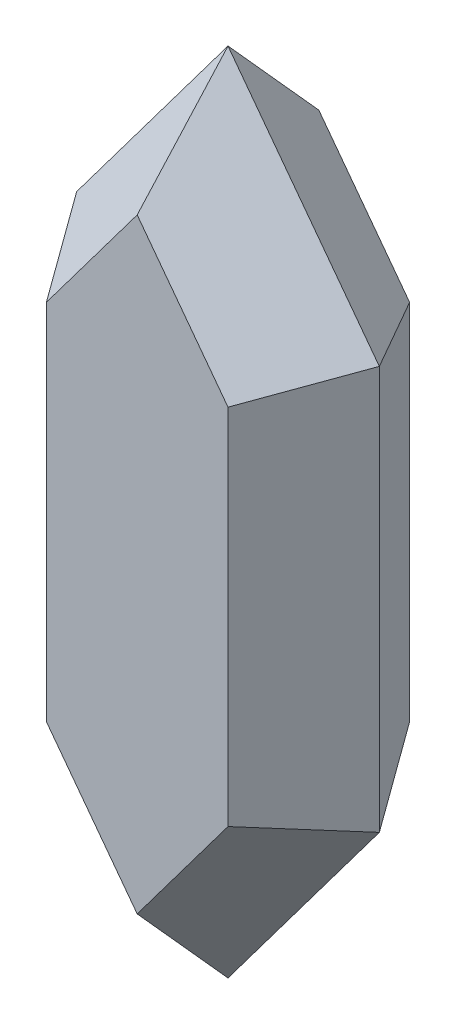
ISO-10303-21;
HEADER;
FILE_DESCRIPTION(('STEP AP214'),'2;1');
FILE_NAME('part.step','',(''),(''),'','','');
FILE_SCHEMA(('AUTOMOTIVE_DESIGN { 1 0 10303 214 1 1 1 1 }'));
ENDSEC;
DATA;
#1=APPLICATION_CONTEXT('core data for automotive mechanical design processes');
#2=APPLICATION_PROTOCOL_DEFINITION('international standard','automotive_design',2000,#1);
#3=PRODUCT_CONTEXT('',#1,'mechanical');
#4=PRODUCT('Part','Part','',(#3));
#5=PRODUCT_RELATED_PRODUCT_CATEGORY('part','',(#4));
#6=PRODUCT_DEFINITION_FORMATION('','',#4);
#7=PRODUCT_DEFINITION_CONTEXT('part definition',#1,'design');
#8=PRODUCT_DEFINITION('design','',#6,#7);
#9=PRODUCT_DEFINITION_SHAPE('','',#8);
#10=(LENGTH_UNIT() NAMED_UNIT(*) SI_UNIT(.MILLI.,.METRE.));
#11=(NAMED_UNIT(*) PLANE_ANGLE_UNIT() SI_UNIT($,.RADIAN.));
#12=(NAMED_UNIT(*) SI_UNIT($,.STERADIAN.) SOLID_ANGLE_UNIT());
#13=UNCERTAINTY_MEASURE_WITH_UNIT(LENGTH_MEASURE(1.E-05),#10,'distance_accuracy_value','');
#14=(GEOMETRIC_REPRESENTATION_CONTEXT(3) GLOBAL_UNCERTAINTY_ASSIGNED_CONTEXT((#13)) GLOBAL_UNIT_ASSIGNED_CONTEXT((#10,
#11,#12)) REPRESENTATION_CONTEXT('',''));
#15=CARTESIAN_POINT('',(0.,0.,0.));
#16=DIRECTION('',(0.,0.,1.));
#17=DIRECTION('',(1.,0.,0.));
#18=AXIS2_PLACEMENT_3D('',#15,#16,#17);
#19=CARTESIAN_POINT('',(0.,0.,9.));
#20=DIRECTION('',(0.,0.,1.));
#21=DIRECTION('',(1.,0.,0.));
#22=AXIS2_PLACEMENT_3D('',#19,#20,#21);
#23=PLANE('',#22);
#24=DIRECTION('',(-0.6,-0.8,0.));
#25=VECTOR('',#24,1.);
#26=CARTESIAN_POINT('',(12.5,50.,9.));
#27=LINE('',#26,#25);
#28=CARTESIAN_POINT('',(12.5,50.,9.));
#29=VERTEX_POINT('',#28);
#30=CARTESIAN_POINT('',(3.5,38.,9.));
#31=VERTEX_POINT('',#30);
#32=EDGE_CURVE('E315',#29,#31,#27,.T.);
#33=ORIENTED_EDGE('',*,*,#32,.T.);
#34=DIRECTION('',(0.,-1.,0.));
#35=VECTOR('',#34,1.);
#36=CARTESIAN_POINT('',(3.5,38.,9.));
#37=LINE('',#36,#35);
#38=CARTESIAN_POINT('',(3.5,2.00000000000001,9.));
#39=VERTEX_POINT('',#38);
#40=EDGE_CURVE('E299',#31,#39,#37,.T.);
#41=ORIENTED_EDGE('',*,*,#40,.T.);
#42=DIRECTION('',(0.6,-0.8,0.));
#43=VECTOR('',#42,1.);
#44=CARTESIAN_POINT('',(3.5,2.00000000000001,9.));
#45=LINE('',#44,#43);
#46=CARTESIAN_POINT('',(12.5,-10.,9.));
#47=VERTEX_POINT('',#46);
#48=EDGE_CURVE('E178',#39,#47,#45,.T.);
#49=ORIENTED_EDGE('',*,*,#48,.T.);
#50=DIRECTION('',(0.6,0.8,0.));
#51=VECTOR('',#50,1.);
#52=CARTESIAN_POINT('',(12.5,-10.,9.));
#53=LINE('',#52,#51);
#54=CARTESIAN_POINT('',(21.5,2.,9.));
#55=VERTEX_POINT('',#54);
#56=EDGE_CURVE('E317',#47,#55,#53,.T.);
#57=ORIENTED_EDGE('',*,*,#56,.T.);
#58=DIRECTION('',(0.,1.,0.));
#59=VECTOR('',#58,1.);
#60=CARTESIAN_POINT('',(21.5,2.,9.));
#61=LINE('',#60,#59);
#62=CARTESIAN_POINT('',(21.5,38.,9.));
#63=VERTEX_POINT('',#62);
#64=EDGE_CURVE('E70',#55,#63,#61,.T.);
#65=ORIENTED_EDGE('',*,*,#64,.T.);
#66=DIRECTION('',(-0.6,0.8,0.));
#67=VECTOR('',#66,1.);
#68=CARTESIAN_POINT('',(21.5,38.,9.));
#69=LINE('',#68,#67);
#70=EDGE_CURVE('E12',#63,#29,#69,.T.);
#71=ORIENTED_EDGE('',*,*,#70,.T.);
#72=EDGE_LOOP('',(#33,#41,#49,#57,#65,#71));
#73=FACE_BOUND('',#72,.T.);
#74=ADVANCED_FACE('F60',(#73),#23,.T.);
#75=CARTESIAN_POINT('',(-1.73076923076923,0.,1.15384615384615));
#76=DIRECTION('',(0.832050294337844,0.,-0.554700196225229));
#77=DIRECTION('',(-0.554700196225229,0.,-0.832050294337844));
#78=AXIS2_PLACEMENT_3D('',#75,#76,#77);
#79=PLANE('',#78);
#80=DIRECTION('',(0.545454545454545,0.181818181818182,0.818181818181818));
#81=VECTOR('',#80,1.);
#82=CARTESIAN_POINT('',(-2.49999999999999,0.,0.));
#83=LINE('',#82,#81);
#84=CARTESIAN_POINT('',(-2.49999999999999,0.,0.));
#85=VERTEX_POINT('',#84);
#86=EDGE_CURVE('E160',#85,#39,#83,.T.);
#87=ORIENTED_EDGE('',*,*,#86,.T.);
#88=ORIENTED_EDGE('',*,*,#40,.F.);
#89=DIRECTION('',(0.545454545454546,-0.181818181818181,0.818181818181818));
#90=VECTOR('',#89,1.);
#91=CARTESIAN_POINT('',(-2.5,40.,0.));
#92=LINE('',#91,#90);
#93=CARTESIAN_POINT('',(-2.5,40.,0.));
#94=VERTEX_POINT('',#93);
#95=EDGE_CURVE('E170',#94,#31,#92,.T.);
#96=ORIENTED_EDGE('',*,*,#95,.F.);
#97=DIRECTION('',(0.,-1.,0.));
#98=VECTOR('',#97,1.);
#99=CARTESIAN_POINT('',(-2.49999999999999,0.,0.));
#100=LINE('',#99,#98);
#101=EDGE_CURVE('E140',#94,#85,#100,.T.);
#102=ORIENTED_EDGE('',*,*,#101,.T.);
#103=EDGE_LOOP('',(#87,#88,#96,#102));
#104=FACE_BOUND('',#103,.T.);
#105=ADVANCED_FACE('F167',(#104),#79,.F.);
#106=CARTESIAN_POINT('',(-14.4,10.8,12.));
#107=DIRECTION('',(0.665640235470275,-0.499230176602706,-0.554700196225229));
#108=DIRECTION('',(-0.64018439966448,0.,-0.768221279597376));
#109=AXIS2_PLACEMENT_3D('',#106,#107,#108);
#110=PLANE('',#109);
#111=ORIENTED_EDGE('',*,*,#95,.T.);
#112=ORIENTED_EDGE('',*,*,#32,.F.);
#113=DIRECTION('',(0.,-0.743294146247166,0.66896473162245));
#114=VECTOR('',#113,1.);
#115=CARTESIAN_POINT('',(12.5,60.,0.));
#116=LINE('',#115,#114);
#117=CARTESIAN_POINT('',(12.5,60.,0.));
#118=VERTEX_POINT('',#117);
#119=EDGE_CURVE('E265',#118,#29,#116,.T.);
#120=ORIENTED_EDGE('',*,*,#119,.F.);
#121=DIRECTION('',(-0.6,-0.8,0.));
#122=VECTOR('',#121,1.);
#123=CARTESIAN_POINT('',(12.5,60.,0.));
#124=LINE('',#123,#122);
#125=EDGE_CURVE('E171',#118,#94,#124,.T.);
#126=ORIENTED_EDGE('',*,*,#125,.T.);
#127=EDGE_LOOP('',(#111,#112,#120,#126));
#128=FACE_BOUND('',#127,.T.);
#129=ADVANCED_FACE('F264',(#128),#110,.F.);
#130=CARTESIAN_POINT('',(-1.1076923076923,-0.830769230769227,0.923076923076919));
#131=DIRECTION('',(0.665640235470275,0.499230176602706,-0.554700196225229));
#132=DIRECTION('',(-0.64018439966448,0.,-0.768221279597376));
#133=AXIS2_PLACEMENT_3D('',#130,#131,#132);
#134=PLANE('',#133);
#135=DIRECTION('',(0.,0.743294146247166,0.66896473162245));
#136=VECTOR('',#135,1.);
#137=CARTESIAN_POINT('',(12.5,-20.,0.));
#138=LINE('',#137,#136);
#139=CARTESIAN_POINT('',(12.5,-20.,0.));
#140=VERTEX_POINT('',#139);
#141=EDGE_CURVE('E181',#140,#47,#138,.T.);
#142=ORIENTED_EDGE('',*,*,#141,.T.);
#143=ORIENTED_EDGE('',*,*,#48,.F.);
#144=ORIENTED_EDGE('',*,*,#86,.F.);
#145=DIRECTION('',(0.6,-0.8,0.));
#146=VECTOR('',#145,1.);
#147=CARTESIAN_POINT('',(12.5,-20.,0.));
#148=LINE('',#147,#146);
#149=EDGE_CURVE('E151',#85,#140,#148,.T.);
#150=ORIENTED_EDGE('',*,*,#149,.T.);
#151=EDGE_LOOP('',(#142,#143,#144,#150));
#152=FACE_BOUND('',#151,.T.);
#153=ADVANCED_FACE('F176',(#152),#134,.F.);
#154=CARTESIAN_POINT('',(12.1846153846154,-9.13846153846154,10.1538461538461));
#155=DIRECTION('',(-0.665640235470275,0.499230176602706,-0.554700196225229));
#156=DIRECTION('',(-0.64018439966448,0.,0.768221279597376));
#157=AXIS2_PLACEMENT_3D('',#154,#155,#156);
#158=PLANE('',#157);
#159=DIRECTION('',(-0.545454545454545,0.181818181818181,0.818181818181818));
#160=VECTOR('',#159,1.);
#161=CARTESIAN_POINT('',(27.5,0.,0.));
#162=LINE('',#161,#160);
#163=CARTESIAN_POINT('',(27.5,0.,0.));
#164=VERTEX_POINT('',#163);
#165=EDGE_CURVE('E191',#164,#55,#162,.T.);
#166=ORIENTED_EDGE('',*,*,#165,.T.);
#167=ORIENTED_EDGE('',*,*,#56,.F.);
#168=ORIENTED_EDGE('',*,*,#141,.F.);
#169=DIRECTION('',(0.6,0.8,0.));
#170=VECTOR('',#169,1.);
#171=CARTESIAN_POINT('',(12.5,-20.,0.));
#172=LINE('',#171,#170);
#173=EDGE_CURVE('E64',#140,#164,#172,.T.);
#174=ORIENTED_EDGE('',*,*,#173,.T.);
#175=EDGE_LOOP('',(#166,#167,#168,#174));
#176=FACE_BOUND('',#175,.T.);
#177=ADVANCED_FACE('F205',(#176),#158,.F.);
#178=CARTESIAN_POINT('',(19.0384615384616,0.,12.6923076923077));
#179=DIRECTION('',(-0.832050294337844,0.,-0.554700196225229));
#180=DIRECTION('',(-0.554700196225229,0.,0.832050294337844));
#181=AXIS2_PLACEMENT_3D('',#178,#179,#180);
#182=PLANE('',#181);
#183=DIRECTION('',(-0.545454545454545,-0.181818181818182,0.818181818181818));
#184=VECTOR('',#183,1.);
#185=CARTESIAN_POINT('',(27.5,40.,0.));
#186=LINE('',#185,#184);
#187=CARTESIAN_POINT('',(27.5,40.,0.));
#188=VERTEX_POINT('',#187);
#189=EDGE_CURVE('E85',#188,#63,#186,.T.);
#190=ORIENTED_EDGE('',*,*,#189,.T.);
#191=ORIENTED_EDGE('',*,*,#64,.F.);
#192=ORIENTED_EDGE('',*,*,#165,.F.);
#193=DIRECTION('',(0.,1.,0.));
#194=VECTOR('',#193,1.);
#195=CARTESIAN_POINT('',(27.5,0.,0.));
#196=LINE('',#195,#194);
#197=EDGE_CURVE('E254',#164,#188,#196,.T.);
#198=ORIENTED_EDGE('',*,*,#197,.T.);
#199=EDGE_LOOP('',(#190,#191,#192,#198));
#200=FACE_BOUND('',#199,.T.);
#201=ADVANCED_FACE('F214',(#200),#182,.F.);
#202=CARTESIAN_POINT('',(25.4769230769231,19.1076923076923,21.2307692307692));
#203=DIRECTION('',(-0.665640235470275,-0.499230176602706,-0.554700196225228));
#204=DIRECTION('',(-0.640184399664479,0.,0.768221279597376));
#205=AXIS2_PLACEMENT_3D('',#202,#203,#204);
#206=PLANE('',#205);
#207=ORIENTED_EDGE('',*,*,#119,.T.);
#208=ORIENTED_EDGE('',*,*,#70,.F.);
#209=ORIENTED_EDGE('',*,*,#189,.F.);
#210=DIRECTION('',(-0.6,0.8,0.));
#211=VECTOR('',#210,1.);
#212=CARTESIAN_POINT('',(12.5,60.,0.));
#213=LINE('',#212,#211);
#214=EDGE_CURVE('E255',#188,#118,#213,.T.);
#215=ORIENTED_EDGE('',*,*,#214,.T.);
#216=EDGE_LOOP('',(#207,#208,#209,#215));
#217=FACE_BOUND('',#216,.T.);
#218=ADVANCED_FACE('F379',(#217),#206,.F.);
#219=CARTESIAN_POINT('',(0.,0.,-9.));
#220=DIRECTION('',(0.,0.,1.));
#221=DIRECTION('',(1.,0.,0.));
#222=AXIS2_PLACEMENT_3D('',#219,#220,#221);
#223=PLANE('',#222);
#224=DIRECTION('',(0.,-1.,0.));
#225=VECTOR('',#224,1.);
#226=CARTESIAN_POINT('',(21.4999999999999,2.,-9.00000000000015));
#227=LINE('',#226,#225);
#228=CARTESIAN_POINT('',(21.4999999999999,38.,-9.00000000000015));
#229=VERTEX_POINT('',#228);
#230=CARTESIAN_POINT('',(21.4999999999999,2.,-9.00000000000015));
#231=VERTEX_POINT('',#230);
#232=EDGE_CURVE('E624',#229,#231,#227,.T.);
#233=ORIENTED_EDGE('',*,*,#232,.T.);
#234=DIRECTION('',(-0.6,-0.8,0.));
#235=VECTOR('',#234,1.);
#236=CARTESIAN_POINT('',(12.4999999999999,-10.,-9.00000000000009));
#237=LINE('',#236,#235);
#238=CARTESIAN_POINT('',(12.4999999999999,-10.,-9.00000000000009));
#239=VERTEX_POINT('',#238);
#240=EDGE_CURVE('E172',#231,#239,#237,.T.);
#241=ORIENTED_EDGE('',*,*,#240,.T.);
#242=DIRECTION('',(-0.6,0.8,0.));
#243=VECTOR('',#242,1.);
#244=CARTESIAN_POINT('',(3.49999999999994,2.00000000000001,-9.00000000000002));
#245=LINE('',#244,#243);
#246=CARTESIAN_POINT('',(3.49999999999994,2.00000000000001,-9.00000000000002));
#247=VERTEX_POINT('',#246);
#248=EDGE_CURVE('E590',#239,#247,#245,.T.);
#249=ORIENTED_EDGE('',*,*,#248,.T.);
#250=DIRECTION('',(0.,1.,0.));
#251=VECTOR('',#250,1.);
#252=CARTESIAN_POINT('',(3.49999999999994,38.,-9.00000000000002));
#253=LINE('',#252,#251);
#254=CARTESIAN_POINT('',(3.49999999999994,38.,-9.00000000000002));
#255=VERTEX_POINT('',#254);
#256=EDGE_CURVE('E143',#247,#255,#253,.T.);
#257=ORIENTED_EDGE('',*,*,#256,.T.);
#258=DIRECTION('',(0.6,0.8,0.));
#259=VECTOR('',#258,1.);
#260=CARTESIAN_POINT('',(12.4999999999999,50.,-9.00000000000009));
#261=LINE('',#260,#259);
#262=CARTESIAN_POINT('',(12.4999999999999,50.,-9.00000000000009));
#263=VERTEX_POINT('',#262);
#264=EDGE_CURVE('E628',#255,#263,#261,.T.);
#265=ORIENTED_EDGE('',*,*,#264,.T.);
#266=DIRECTION('',(0.6,-0.8,0.));
#267=VECTOR('',#266,1.);
#268=CARTESIAN_POINT('',(21.4999999999999,38.,-9.00000000000015));
#269=LINE('',#268,#267);
#270=EDGE_CURVE('E524',#263,#229,#269,.T.);
#271=ORIENTED_EDGE('',*,*,#270,.T.);
#272=EDGE_LOOP('',(#233,#241,#249,#257,#265,#271));
#273=FACE_BOUND('',#272,.T.);
#274=ADVANCED_FACE('F387',(#273),#223,.F.);
#275=CARTESIAN_POINT('',(19.0384615384616,0.,-12.6923076923077));
#276=DIRECTION('',(-0.832050294337845,0.,0.554700196225227));
#277=DIRECTION('',(0.554700196225227,0.,0.832050294337845));
#278=AXIS2_PLACEMENT_3D('',#275,#276,#277);
#279=PLANE('',#278);
#280=DIRECTION('',(-0.545454545454543,0.181818181818179,-0.81818181818182));
#281=VECTOR('',#280,1.);
#282=CARTESIAN_POINT('',(27.5,0.,0.));
#283=LINE('',#282,#281);
#284=EDGE_CURVE('E552',#164,#231,#283,.T.);
#285=ORIENTED_EDGE('',*,*,#284,.T.);
#286=ORIENTED_EDGE('',*,*,#232,.F.);
#287=DIRECTION('',(-0.545454545454543,-0.181818181818179,-0.81818181818182));
#288=VECTOR('',#287,1.);
#289=CARTESIAN_POINT('',(27.5,40.,0.));
#290=LINE('',#289,#288);
#291=EDGE_CURVE('E545',#188,#229,#290,.T.);
#292=ORIENTED_EDGE('',*,*,#291,.F.);
#293=ORIENTED_EDGE('',*,*,#197,.F.);
#294=EDGE_LOOP('',(#285,#286,#292,#293));
#295=FACE_BOUND('',#294,.T.);
#296=ADVANCED_FACE('F408',(#295),#279,.F.);
#297=CARTESIAN_POINT('',(25.4769230769232,19.1076923076925,-21.2307692307692));
#298=DIRECTION('',(-0.665640235470275,-0.49923017660271,0.554700196225225));
#299=DIRECTION('',(0.640184399664477,0.,0.768221279597378));
#300=AXIS2_PLACEMENT_3D('',#297,#298,#299);
#301=PLANE('',#300);
#302=ORIENTED_EDGE('',*,*,#291,.T.);
#303=ORIENTED_EDGE('',*,*,#270,.F.);
#304=DIRECTION('',(0.,-0.743294146247163,-0.668964731622453));
#305=VECTOR('',#304,1.);
#306=CARTESIAN_POINT('',(12.5,60.,0.));
#307=LINE('',#306,#305);
#308=EDGE_CURVE('E622',#118,#263,#307,.T.);
#309=ORIENTED_EDGE('',*,*,#308,.F.);
#310=ORIENTED_EDGE('',*,*,#214,.F.);
#311=EDGE_LOOP('',(#302,#303,#309,#310));
#312=FACE_BOUND('',#311,.T.);
#313=ADVANCED_FACE('F452',(#312),#301,.F.);
#314=CARTESIAN_POINT('',(12.1846153846154,-9.13846153846157,-10.1538461538462));
#315=DIRECTION('',(-0.665640235470273,0.499230176602708,0.55470019622523));
#316=DIRECTION('',(0.640184399664481,0.,0.768221279597374));
#317=AXIS2_PLACEMENT_3D('',#314,#315,#316);
#318=PLANE('',#317);
#319=DIRECTION('',(0.,0.743294146247163,-0.668964731622453));
#320=VECTOR('',#319,1.);
#321=CARTESIAN_POINT('',(12.5,-20.,0.));
#322=LINE('',#321,#320);
#323=EDGE_CURVE('E148',#140,#239,#322,.T.);
#324=ORIENTED_EDGE('',*,*,#323,.T.);
#325=ORIENTED_EDGE('',*,*,#240,.F.);
#326=ORIENTED_EDGE('',*,*,#284,.F.);
#327=ORIENTED_EDGE('',*,*,#173,.F.);
#328=EDGE_LOOP('',(#324,#325,#326,#327));
#329=FACE_BOUND('',#328,.T.);
#330=ADVANCED_FACE('F462',(#329),#318,.F.);
#331=CARTESIAN_POINT('',(-1.10769230769232,-0.830769230769232,-0.923076923076918));
#332=DIRECTION('',(0.665640235470278,0.499230176602706,0.554700196225225));
#333=DIRECTION('',(0.640184399664475,0.,-0.76822127959738));
#334=AXIS2_PLACEMENT_3D('',#331,#332,#333);
#335=PLANE('',#334);
#336=DIRECTION('',(0.54545454545454,0.181818181818183,-0.818181818181822));
#337=VECTOR('',#336,1.);
#338=CARTESIAN_POINT('',(-2.49999999999999,0.,0.));
#339=LINE('',#338,#337);
#340=EDGE_CURVE('E135',#85,#247,#339,.T.);
#341=ORIENTED_EDGE('',*,*,#340,.T.);
#342=ORIENTED_EDGE('',*,*,#248,.F.);
#343=ORIENTED_EDGE('',*,*,#323,.F.);
#344=ORIENTED_EDGE('',*,*,#149,.F.);
#345=EDGE_LOOP('',(#341,#342,#343,#344));
#346=FACE_BOUND('',#345,.T.);
#347=ADVANCED_FACE('F153',(#346),#335,.F.);
#348=CARTESIAN_POINT('',(-1.73076923076925,0.,-1.15384615384615));
#349=DIRECTION('',(0.832050294337847,0.,0.554700196225224));
#350=DIRECTION('',(0.554700196225224,0.,-0.832050294337847));
#351=AXIS2_PLACEMENT_3D('',#348,#349,#350);
#352=PLANE('',#351);
#353=DIRECTION('',(0.545454545454541,-0.181818181818182,-0.818181818181822));
#354=VECTOR('',#353,1.);
#355=CARTESIAN_POINT('',(-2.5,40.,0.));
#356=LINE('',#355,#354);
#357=EDGE_CURVE('E147',#94,#255,#356,.T.);
#358=ORIENTED_EDGE('',*,*,#357,.T.);
#359=ORIENTED_EDGE('',*,*,#256,.F.);
#360=ORIENTED_EDGE('',*,*,#340,.F.);
#361=ORIENTED_EDGE('',*,*,#101,.F.);
#362=EDGE_LOOP('',(#358,#359,#360,#361));
#363=FACE_BOUND('',#362,.T.);
#364=ADVANCED_FACE('F138',(#363),#352,.F.);
#365=CARTESIAN_POINT('',(-14.4000000000001,10.8,-11.9999999999998));
#366=DIRECTION('',(0.665640235470281,-0.499230176602708,0.554700196225221));
#367=DIRECTION('',(0.640184399664471,0.,-0.768221279597383));
#368=AXIS2_PLACEMENT_3D('',#365,#366,#367);
#369=PLANE('',#368);
#370=ORIENTED_EDGE('',*,*,#308,.T.);
#371=ORIENTED_EDGE('',*,*,#264,.F.);
#372=ORIENTED_EDGE('',*,*,#357,.F.);
#373=ORIENTED_EDGE('',*,*,#125,.F.);
#374=EDGE_LOOP('',(#370,#371,#372,#373));
#375=FACE_BOUND('',#374,.T.);
#376=ADVANCED_FACE('F489',(#375),#369,.F.);
#377=CLOSED_SHELL('',(#74,#105,#129,#153,#177,#201,#218,#274,#296,#313,#330,#347,#364,#376));
#378=MANIFOLD_SOLID_BREP('B2',#377);
#379=ADVANCED_BREP_SHAPE_REPRESENTATION('',(#18,#378),#14);
#380=SHAPE_DEFINITION_REPRESENTATION(#9,#379);
ENDSEC;
END-ISO-10303-21;
